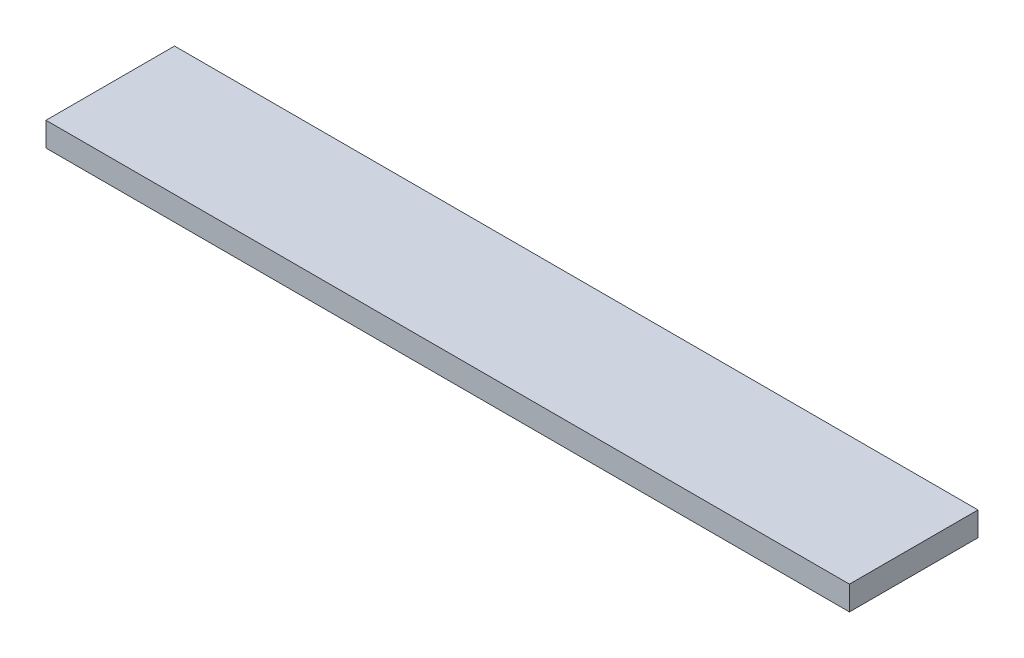
ISO-10303-21;
HEADER;
FILE_DESCRIPTION(('STEP AP214'),'2;1');
FILE_NAME('part.step','',(''),(''),'','','');
FILE_SCHEMA(('AUTOMOTIVE_DESIGN { 1 0 10303 214 1 1 1 1 }'));
ENDSEC;
DATA;
#1=APPLICATION_CONTEXT('core data for automotive mechanical design processes');
#2=APPLICATION_PROTOCOL_DEFINITION('international standard','automotive_design',2000,#1);
#3=PRODUCT_CONTEXT('',#1,'mechanical');
#4=PRODUCT('Part','Part','',(#3));
#5=PRODUCT_RELATED_PRODUCT_CATEGORY('part','',(#4));
#6=PRODUCT_DEFINITION_FORMATION('','',#4);
#7=PRODUCT_DEFINITION_CONTEXT('part definition',#1,'design');
#8=PRODUCT_DEFINITION('design','',#6,#7);
#9=PRODUCT_DEFINITION_SHAPE('','',#8);
#10=(LENGTH_UNIT() NAMED_UNIT(*) SI_UNIT(.MILLI.,.METRE.));
#11=(NAMED_UNIT(*) PLANE_ANGLE_UNIT() SI_UNIT($,.RADIAN.));
#12=(NAMED_UNIT(*) SI_UNIT($,.STERADIAN.) SOLID_ANGLE_UNIT());
#13=UNCERTAINTY_MEASURE_WITH_UNIT(LENGTH_MEASURE(1.E-05),#10,'distance_accuracy_value','');
#14=(GEOMETRIC_REPRESENTATION_CONTEXT(3) GLOBAL_UNCERTAINTY_ASSIGNED_CONTEXT((#13)) GLOBAL_UNIT_ASSIGNED_CONTEXT((#10,
#11,#12)) REPRESENTATION_CONTEXT('',''));
#15=CARTESIAN_POINT('',(0.,0.,0.));
#16=DIRECTION('',(0.,0.,1.));
#17=DIRECTION('',(1.,0.,0.));
#18=AXIS2_PLACEMENT_3D('',#15,#16,#17);
#19=CARTESIAN_POINT('',(416.25,-621.,143.5));
#20=DIRECTION('',(1.,0.,0.));
#21=DIRECTION('',(0.,1.,0.));
#22=AXIS2_PLACEMENT_3D('',#19,#20,#21);
#23=PLANE('',#22);
#24=CARTESIAN_POINT('',(416.25,-621.,183.5));
#25=DIRECTION('',(0.,1.,0.));
#26=VECTOR('',#25,1.);
#27=LINE('',#24,#26);
#28=CARTESIAN_POINT('',(416.25,-621.,183.5));
#29=VERTEX_POINT('',#28);
#30=CARTESIAN_POINT('',(416.25,-606.,183.5));
#31=VERTEX_POINT('',#30);
#32=EDGE_CURVE('E75',#29,#31,#27,.T.);
#33=ORIENTED_EDGE('',*,*,#32,.F.);
#34=CARTESIAN_POINT('',(416.25,-621.,103.5));
#35=DIRECTION('',(0.,0.,1.));
#36=VECTOR('',#35,1.);
#37=LINE('',#34,#36);
#38=CARTESIAN_POINT('',(416.25,-621.,103.5));
#39=VERTEX_POINT('',#38);
#40=EDGE_CURVE('E58',#39,#29,#37,.T.);
#41=ORIENTED_EDGE('',*,*,#40,.F.);
#42=CARTESIAN_POINT('',(416.25,-606.,103.5));
#43=DIRECTION('',(0.,-1.,0.));
#44=VECTOR('',#43,1.);
#45=LINE('',#42,#44);
#46=CARTESIAN_POINT('',(416.25,-606.,103.5));
#47=VERTEX_POINT('',#46);
#48=EDGE_CURVE('E71',#47,#39,#45,.T.);
#49=ORIENTED_EDGE('',*,*,#48,.F.);
#50=CARTESIAN_POINT('',(416.25,-606.,183.5));
#51=DIRECTION('',(0.,0.,-1.));
#52=VECTOR('',#51,1.);
#53=LINE('',#50,#52);
#54=EDGE_CURVE('E78',#31,#47,#53,.T.);
#55=ORIENTED_EDGE('',*,*,#54,.F.);
#56=EDGE_LOOP('',(#33,#41,#49,#55));
#57=FACE_BOUND('',#56,.T.);
#58=ADVANCED_FACE('F17',(#57),#23,.T.);
#59=CARTESIAN_POINT('',(-83.75,-621.,183.5));
#60=DIRECTION('',(0.,-1.,0.));
#61=DIRECTION('',(0.,0.,-1.));
#62=AXIS2_PLACEMENT_3D('',#59,#60,#61);
#63=PLANE('',#62);
#64=CARTESIAN_POINT('',(-83.75,-621.,183.5));
#65=DIRECTION('',(1.,0.,0.));
#66=VECTOR('',#65,1.);
#67=LINE('',#64,#66);
#68=CARTESIAN_POINT('',(-83.75,-621.,183.5));
#69=VERTEX_POINT('',#68);
#70=EDGE_CURVE('E63',#69,#29,#67,.T.);
#71=ORIENTED_EDGE('',*,*,#70,.F.);
#72=CARTESIAN_POINT('',(-83.75,-621.,183.5));
#73=DIRECTION('',(0.,0.,-1.));
#74=VECTOR('',#73,1.);
#75=LINE('',#72,#74);
#76=CARTESIAN_POINT('',(-83.75,-621.,103.5));
#77=VERTEX_POINT('',#76);
#78=EDGE_CURVE('E225',#69,#77,#75,.T.);
#79=ORIENTED_EDGE('',*,*,#78,.T.);
#80=CARTESIAN_POINT('',(416.25,-621.,103.5));
#81=DIRECTION('',(-1.,0.,0.));
#82=VECTOR('',#81,1.);
#83=LINE('',#80,#82);
#84=EDGE_CURVE('E66',#39,#77,#83,.T.);
#85=ORIENTED_EDGE('',*,*,#84,.F.);
#86=ORIENTED_EDGE('',*,*,#40,.T.);
#87=EDGE_LOOP('',(#71,#79,#85,#86));
#88=FACE_BOUND('',#87,.T.);
#89=ADVANCED_FACE('F61',(#88),#63,.T.);
#90=CARTESIAN_POINT('',(-83.75,-621.,103.5));
#91=DIRECTION('',(0.,0.,-1.));
#92=DIRECTION('',(0.,-1.,0.));
#93=AXIS2_PLACEMENT_3D('',#90,#91,#92);
#94=PLANE('',#93);
#95=ORIENTED_EDGE('',*,*,#84,.T.);
#96=CARTESIAN_POINT('',(-83.75,-621.,103.5));
#97=DIRECTION('',(0.,1.,0.));
#98=VECTOR('',#97,1.);
#99=LINE('',#96,#98);
#100=CARTESIAN_POINT('',(-83.75,-606.,103.5));
#101=VERTEX_POINT('',#100);
#102=EDGE_CURVE('E207',#77,#101,#99,.T.);
#103=ORIENTED_EDGE('',*,*,#102,.T.);
#104=CARTESIAN_POINT('',(416.25,-606.,103.5));
#105=DIRECTION('',(-1.,0.,0.));
#106=VECTOR('',#105,1.);
#107=LINE('',#104,#106);
#108=EDGE_CURVE('E92',#47,#101,#107,.T.);
#109=ORIENTED_EDGE('',*,*,#108,.F.);
#110=ORIENTED_EDGE('',*,*,#48,.T.);
#111=EDGE_LOOP('',(#95,#103,#109,#110));
#112=FACE_BOUND('',#111,.T.);
#113=ADVANCED_FACE('F181',(#112),#94,.T.);
#114=CARTESIAN_POINT('',(-83.75,-606.,103.5));
#115=DIRECTION('',(0.,1.,0.));
#116=DIRECTION('',(1.,0.,0.));
#117=AXIS2_PLACEMENT_3D('',#114,#115,#116);
#118=PLANE('',#117);
#119=ORIENTED_EDGE('',*,*,#108,.T.);
#120=CARTESIAN_POINT('',(-83.75,-606.,103.5));
#121=DIRECTION('',(0.,0.,1.));
#122=VECTOR('',#121,1.);
#123=LINE('',#120,#122);
#124=CARTESIAN_POINT('',(-83.75,-606.,183.5));
#125=VERTEX_POINT('',#124);
#126=EDGE_CURVE('E29',#101,#125,#123,.T.);
#127=ORIENTED_EDGE('',*,*,#126,.T.);
#128=CARTESIAN_POINT('',(416.25,-606.,183.5));
#129=DIRECTION('',(-1.,0.,0.));
#130=VECTOR('',#129,1.);
#131=LINE('',#128,#130);
#132=EDGE_CURVE('E83',#31,#125,#131,.T.);
#133=ORIENTED_EDGE('',*,*,#132,.F.);
#134=ORIENTED_EDGE('',*,*,#54,.T.);
#135=EDGE_LOOP('',(#119,#127,#133,#134));
#136=FACE_BOUND('',#135,.T.);
#137=ADVANCED_FACE('F112',(#136),#118,.T.);
#138=CARTESIAN_POINT('',(-83.75,-606.,183.5));
#139=DIRECTION('',(0.,0.,1.));
#140=DIRECTION('',(1.,0.,0.));
#141=AXIS2_PLACEMENT_3D('',#138,#139,#140);
#142=PLANE('',#141);
#143=ORIENTED_EDGE('',*,*,#132,.T.);
#144=CARTESIAN_POINT('',(-83.75,-606.,183.5));
#145=DIRECTION('',(0.,-1.,0.));
#146=VECTOR('',#145,1.);
#147=LINE('',#144,#146);
#148=EDGE_CURVE('E11',#125,#69,#147,.T.);
#149=ORIENTED_EDGE('',*,*,#148,.T.);
#150=ORIENTED_EDGE('',*,*,#70,.T.);
#151=ORIENTED_EDGE('',*,*,#32,.T.);
#152=EDGE_LOOP('',(#143,#149,#150,#151));
#153=FACE_BOUND('',#152,.T.);
#154=ADVANCED_FACE('F87',(#153),#142,.T.);
#155=CARTESIAN_POINT('',(-83.75,-621.,143.5));
#156=DIRECTION('',(1.,0.,0.));
#157=DIRECTION('',(0.,1.,0.));
#158=AXIS2_PLACEMENT_3D('',#155,#156,#157);
#159=PLANE('',#158);
#160=ORIENTED_EDGE('',*,*,#126,.F.);
#161=ORIENTED_EDGE('',*,*,#102,.F.);
#162=ORIENTED_EDGE('',*,*,#78,.F.);
#163=ORIENTED_EDGE('',*,*,#148,.F.);
#164=EDGE_LOOP('',(#160,#161,#162,#163));
#165=FACE_BOUND('',#164,.T.);
#166=ADVANCED_FACE('F111',(#165),#159,.F.);
#167=CLOSED_SHELL('',(#58,#89,#113,#137,#154,#166));
#168=MANIFOLD_SOLID_BREP('B1',#167);
#169=ADVANCED_BREP_SHAPE_REPRESENTATION('',(#18,#168),#14);
#170=SHAPE_DEFINITION_REPRESENTATION(#9,#169);
ENDSEC;
END-ISO-10303-21;
